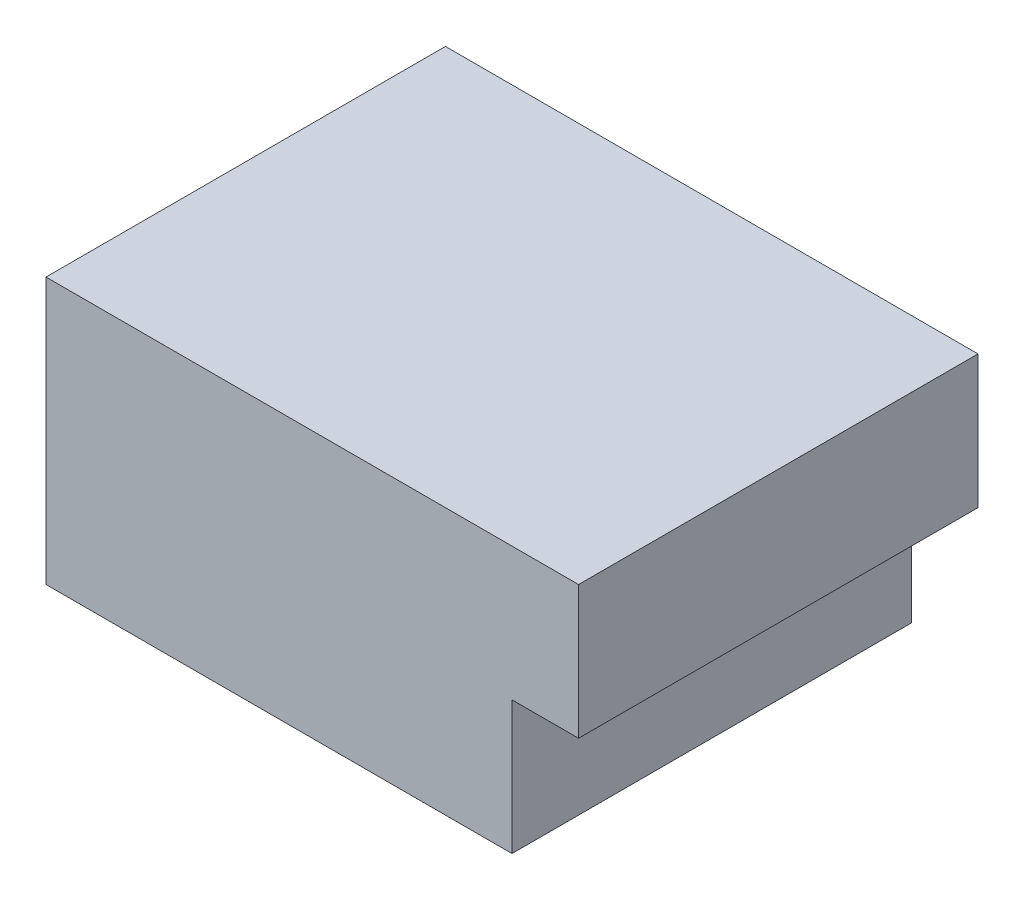
ISO-10303-21;
HEADER;
FILE_DESCRIPTION(('STEP AP214'),'2;1');
FILE_NAME('part.step','',(''),(''),'','','');
FILE_SCHEMA(('AUTOMOTIVE_DESIGN { 1 0 10303 214 1 1 1 1 }'));
ENDSEC;
DATA;
#1=APPLICATION_CONTEXT('core data for automotive mechanical design processes');
#2=APPLICATION_PROTOCOL_DEFINITION('international standard','automotive_design',2000,#1);
#3=PRODUCT_CONTEXT('',#1,'mechanical');
#4=PRODUCT('Part','Part','',(#3));
#5=PRODUCT_RELATED_PRODUCT_CATEGORY('part','',(#4));
#6=PRODUCT_DEFINITION_FORMATION('','',#4);
#7=PRODUCT_DEFINITION_CONTEXT('part definition',#1,'design');
#8=PRODUCT_DEFINITION('design','',#6,#7);
#9=PRODUCT_DEFINITION_SHAPE('','',#8);
#10=(LENGTH_UNIT() NAMED_UNIT(*) SI_UNIT(.MILLI.,.METRE.));
#11=(NAMED_UNIT(*) PLANE_ANGLE_UNIT() SI_UNIT($,.RADIAN.));
#12=(NAMED_UNIT(*) SI_UNIT($,.STERADIAN.) SOLID_ANGLE_UNIT());
#13=UNCERTAINTY_MEASURE_WITH_UNIT(LENGTH_MEASURE(1.E-05),#10,'distance_accuracy_value','');
#14=(GEOMETRIC_REPRESENTATION_CONTEXT(3) GLOBAL_UNCERTAINTY_ASSIGNED_CONTEXT((#13)) GLOBAL_UNIT_ASSIGNED_CONTEXT((#10,
#11,#12)) REPRESENTATION_CONTEXT('',''));
#15=CARTESIAN_POINT('',(0.,0.,0.));
#16=DIRECTION('',(0.,0.,1.));
#17=DIRECTION('',(1.,0.,0.));
#18=AXIS2_PLACEMENT_3D('',#15,#16,#17);
#19=CARTESIAN_POINT('',(0.,0.,0.));
#20=DIRECTION('',(0.,1.,0.));
#21=DIRECTION('',(1.,0.,0.));
#22=AXIS2_PLACEMENT_3D('',#19,#20,#21);
#23=PLANE('',#22);
#24=DIRECTION('',(1.,0.,0.));
#25=VECTOR('',#24,1.);
#26=CARTESIAN_POINT('',(1.6,0.,0.25));
#27=LINE('',#26,#25);
#28=CARTESIAN_POINT('',(1.6,0.,0.25));
#29=VERTEX_POINT('',#28);
#30=CARTESIAN_POINT('',(1.95,0.,0.25));
#31=VERTEX_POINT('',#30);
#32=EDGE_CURVE('E11',#29,#31,#27,.T.);
#33=ORIENTED_EDGE('',*,*,#32,.T.);
#34=DIRECTION('',(0.,0.,-1.));
#35=VECTOR('',#34,1.);
#36=CARTESIAN_POINT('',(1.95,0.,0.55));
#37=LINE('',#36,#35);
#38=CARTESIAN_POINT('',(1.95,0.,0.55));
#39=VERTEX_POINT('',#38);
#40=EDGE_CURVE('E115',#39,#31,#37,.T.);
#41=ORIENTED_EDGE('',*,*,#40,.F.);
#42=DIRECTION('',(-1.,0.,0.));
#43=VECTOR('',#42,1.);
#44=CARTESIAN_POINT('',(1.95,0.,0.55));
#45=LINE('',#44,#43);
#46=CARTESIAN_POINT('',(1.6,0.,0.55));
#47=VERTEX_POINT('',#46);
#48=EDGE_CURVE('E78',#39,#47,#45,.T.);
#49=ORIENTED_EDGE('',*,*,#48,.T.);
#50=DIRECTION('',(0.,0.,1.));
#51=VECTOR('',#50,1.);
#52=CARTESIAN_POINT('',(1.6,0.,0.25));
#53=LINE('',#52,#51);
#54=EDGE_CURVE('E106',#29,#47,#53,.T.);
#55=ORIENTED_EDGE('',*,*,#54,.F.);
#56=EDGE_LOOP('',(#33,#41,#49,#55));
#57=FACE_BOUND('',#56,.T.);
#58=ADVANCED_FACE('F17',(#57),#23,.F.);
#59=CARTESIAN_POINT('',(1.6,0.,0.25));
#60=DIRECTION('',(-1.,0.,0.));
#61=DIRECTION('',(0.,0.,1.));
#62=AXIS2_PLACEMENT_3D('',#59,#60,#61);
#63=PLANE('',#62);
#64=DIRECTION('',(0.,1.,0.));
#65=VECTOR('',#64,1.);
#66=CARTESIAN_POINT('',(1.6,0.,0.55));
#67=LINE('',#66,#65);
#68=CARTESIAN_POINT('',(1.6,0.2,0.55));
#69=VERTEX_POINT('',#68);
#70=EDGE_CURVE('E24',#47,#69,#67,.T.);
#71=ORIENTED_EDGE('',*,*,#70,.T.);
#72=DIRECTION('',(0.,0.,-1.));
#73=VECTOR('',#72,1.);
#74=CARTESIAN_POINT('',(1.6,0.2,0.55));
#75=LINE('',#74,#73);
#76=CARTESIAN_POINT('',(1.6,0.2,0.25));
#77=VERTEX_POINT('',#76);
#78=EDGE_CURVE('E91',#69,#77,#75,.T.);
#79=ORIENTED_EDGE('',*,*,#78,.T.);
#80=DIRECTION('',(0.,1.,0.));
#81=VECTOR('',#80,1.);
#82=CARTESIAN_POINT('',(1.6,0.,0.25));
#83=LINE('',#82,#81);
#84=EDGE_CURVE('E108',#29,#77,#83,.T.);
#85=ORIENTED_EDGE('',*,*,#84,.F.);
#86=ORIENTED_EDGE('',*,*,#54,.T.);
#87=EDGE_LOOP('',(#71,#79,#85,#86));
#88=FACE_BOUND('',#87,.T.);
#89=ADVANCED_FACE('F121',(#88),#63,.T.);
#90=CARTESIAN_POINT('',(2.,0.,0.25));
#91=DIRECTION('',(0.,0.,-1.));
#92=DIRECTION('',(-1.,0.,0.));
#93=AXIS2_PLACEMENT_3D('',#90,#91,#92);
#94=PLANE('',#93);
#95=DIRECTION('',(0.,1.,0.));
#96=VECTOR('',#95,1.);
#97=CARTESIAN_POINT('',(2.,0.1,0.25));
#98=LINE('',#97,#96);
#99=CARTESIAN_POINT('',(2.,0.1,0.25));
#100=VERTEX_POINT('',#99);
#101=CARTESIAN_POINT('',(2.,0.2,0.25));
#102=VERTEX_POINT('',#101);
#103=EDGE_CURVE('E73',#100,#102,#98,.T.);
#104=ORIENTED_EDGE('',*,*,#103,.F.);
#105=DIRECTION('',(-1.,0.,0.));
#106=VECTOR('',#105,1.);
#107=CARTESIAN_POINT('',(2.,0.1,0.25));
#108=LINE('',#107,#106);
#109=CARTESIAN_POINT('',(1.95,0.1,0.25));
#110=VERTEX_POINT('',#109);
#111=EDGE_CURVE('E79',#100,#110,#108,.T.);
#112=ORIENTED_EDGE('',*,*,#111,.T.);
#113=DIRECTION('',(0.,1.,0.));
#114=VECTOR('',#113,1.);
#115=CARTESIAN_POINT('',(1.95,0.,0.25));
#116=LINE('',#115,#114);
#117=EDGE_CURVE('E99',#31,#110,#116,.T.);
#118=ORIENTED_EDGE('',*,*,#117,.F.);
#119=ORIENTED_EDGE('',*,*,#32,.F.);
#120=ORIENTED_EDGE('',*,*,#84,.T.);
#121=DIRECTION('',(1.,0.,0.));
#122=VECTOR('',#121,1.);
#123=CARTESIAN_POINT('',(1.6,0.2,0.25));
#124=LINE('',#123,#122);
#125=EDGE_CURVE('E102',#77,#102,#124,.T.);
#126=ORIENTED_EDGE('',*,*,#125,.T.);
#127=EDGE_LOOP('',(#104,#112,#118,#119,#120,#126));
#128=FACE_BOUND('',#127,.T.);
#129=ADVANCED_FACE('F123',(#128),#94,.T.);
#130=CARTESIAN_POINT('',(0.,0.2,0.));
#131=DIRECTION('',(0.,1.,0.));
#132=DIRECTION('',(1.,0.,0.));
#133=AXIS2_PLACEMENT_3D('',#130,#131,#132);
#134=PLANE('',#133);
#135=DIRECTION('',(0.,0.,-1.));
#136=VECTOR('',#135,1.);
#137=CARTESIAN_POINT('',(2.,0.2,0.55));
#138=LINE('',#137,#136);
#139=CARTESIAN_POINT('',(2.,0.2,0.55));
#140=VERTEX_POINT('',#139);
#141=EDGE_CURVE('E68',#140,#102,#138,.T.);
#142=ORIENTED_EDGE('',*,*,#141,.T.);
#143=ORIENTED_EDGE('',*,*,#125,.F.);
#144=ORIENTED_EDGE('',*,*,#78,.F.);
#145=DIRECTION('',(-1.,0.,0.));
#146=VECTOR('',#145,1.);
#147=CARTESIAN_POINT('',(2.,0.2,0.55));
#148=LINE('',#147,#146);
#149=EDGE_CURVE('E84',#140,#69,#148,.T.);
#150=ORIENTED_EDGE('',*,*,#149,.F.);
#151=EDGE_LOOP('',(#142,#143,#144,#150));
#152=FACE_BOUND('',#151,.T.);
#153=ADVANCED_FACE('F90',(#152),#134,.T.);
#154=CARTESIAN_POINT('',(1.75,0.,0.55));
#155=DIRECTION('',(0.,0.,1.));
#156=DIRECTION('',(1.,0.,0.));
#157=AXIS2_PLACEMENT_3D('',#154,#155,#156);
#158=PLANE('',#157);
#159=DIRECTION('',(0.,1.,0.));
#160=VECTOR('',#159,1.);
#161=CARTESIAN_POINT('',(1.95,0.,0.55));
#162=LINE('',#161,#160);
#163=CARTESIAN_POINT('',(1.95,0.1,0.55));
#164=VERTEX_POINT('',#163);
#165=EDGE_CURVE('E104',#39,#164,#162,.T.);
#166=ORIENTED_EDGE('',*,*,#165,.T.);
#167=DIRECTION('',(-1.,0.,0.));
#168=VECTOR('',#167,1.);
#169=CARTESIAN_POINT('',(2.,0.1,0.55));
#170=LINE('',#169,#168);
#171=CARTESIAN_POINT('',(2.,0.1,0.55));
#172=VERTEX_POINT('',#171);
#173=EDGE_CURVE('E86',#172,#164,#170,.T.);
#174=ORIENTED_EDGE('',*,*,#173,.F.);
#175=DIRECTION('',(0.,1.,0.));
#176=VECTOR('',#175,1.);
#177=CARTESIAN_POINT('',(2.,0.1,0.55));
#178=LINE('',#177,#176);
#179=EDGE_CURVE('E72',#172,#140,#178,.T.);
#180=ORIENTED_EDGE('',*,*,#179,.T.);
#181=ORIENTED_EDGE('',*,*,#149,.T.);
#182=ORIENTED_EDGE('',*,*,#70,.F.);
#183=ORIENTED_EDGE('',*,*,#48,.F.);
#184=EDGE_LOOP('',(#166,#174,#180,#181,#182,#183));
#185=FACE_BOUND('',#184,.T.);
#186=ADVANCED_FACE('F83',(#185),#158,.T.);
#187=CARTESIAN_POINT('',(2.,0.,0.55));
#188=DIRECTION('',(1.,0.,0.));
#189=DIRECTION('',(0.,0.,-1.));
#190=AXIS2_PLACEMENT_3D('',#187,#188,#189);
#191=PLANE('',#190);
#192=ORIENTED_EDGE('',*,*,#103,.T.);
#193=ORIENTED_EDGE('',*,*,#141,.F.);
#194=ORIENTED_EDGE('',*,*,#179,.F.);
#195=DIRECTION('',(0.,0.,-1.));
#196=VECTOR('',#195,1.);
#197=CARTESIAN_POINT('',(2.,0.1,0.55));
#198=LINE('',#197,#196);
#199=EDGE_CURVE('E88',#172,#100,#198,.T.);
#200=ORIENTED_EDGE('',*,*,#199,.T.);
#201=EDGE_LOOP('',(#192,#193,#194,#200));
#202=FACE_BOUND('',#201,.T.);
#203=ADVANCED_FACE('F70',(#202),#191,.T.);
#204=CARTESIAN_POINT('',(2.,0.1,-1.92));
#205=DIRECTION('',(0.,1.,0.));
#206=DIRECTION('',(-1.,0.,0.));
#207=AXIS2_PLACEMENT_3D('',#204,#205,#206);
#208=PLANE('',#207);
#209=ORIENTED_EDGE('',*,*,#199,.F.);
#210=ORIENTED_EDGE('',*,*,#173,.T.);
#211=DIRECTION('',(0.,0.,1.));
#212=VECTOR('',#211,1.);
#213=CARTESIAN_POINT('',(1.95,0.1,0.25));
#214=LINE('',#213,#212);
#215=EDGE_CURVE('E92',#110,#164,#214,.T.);
#216=ORIENTED_EDGE('',*,*,#215,.F.);
#217=ORIENTED_EDGE('',*,*,#111,.F.);
#218=EDGE_LOOP('',(#209,#210,#216,#217));
#219=FACE_BOUND('',#218,.T.);
#220=ADVANCED_FACE('F127',(#219),#208,.F.);
#221=CARTESIAN_POINT('',(1.95,0.1,-1.92));
#222=DIRECTION('',(-1.,0.,0.));
#223=DIRECTION('',(0.,-1.,0.));
#224=AXIS2_PLACEMENT_3D('',#221,#222,#223);
#225=PLANE('',#224);
#226=ORIENTED_EDGE('',*,*,#215,.T.);
#227=ORIENTED_EDGE('',*,*,#165,.F.);
#228=ORIENTED_EDGE('',*,*,#40,.T.);
#229=ORIENTED_EDGE('',*,*,#117,.T.);
#230=EDGE_LOOP('',(#226,#227,#228,#229));
#231=FACE_BOUND('',#230,.T.);
#232=ADVANCED_FACE('F119',(#231),#225,.F.);
#233=CLOSED_SHELL('',(#58,#89,#129,#153,#186,#203,#220,#232));
#234=MANIFOLD_SOLID_BREP('B1',#233);
#235=ADVANCED_BREP_SHAPE_REPRESENTATION('',(#18,#234),#14);
#236=SHAPE_DEFINITION_REPRESENTATION(#9,#235);
ENDSEC;
END-ISO-10303-21;
